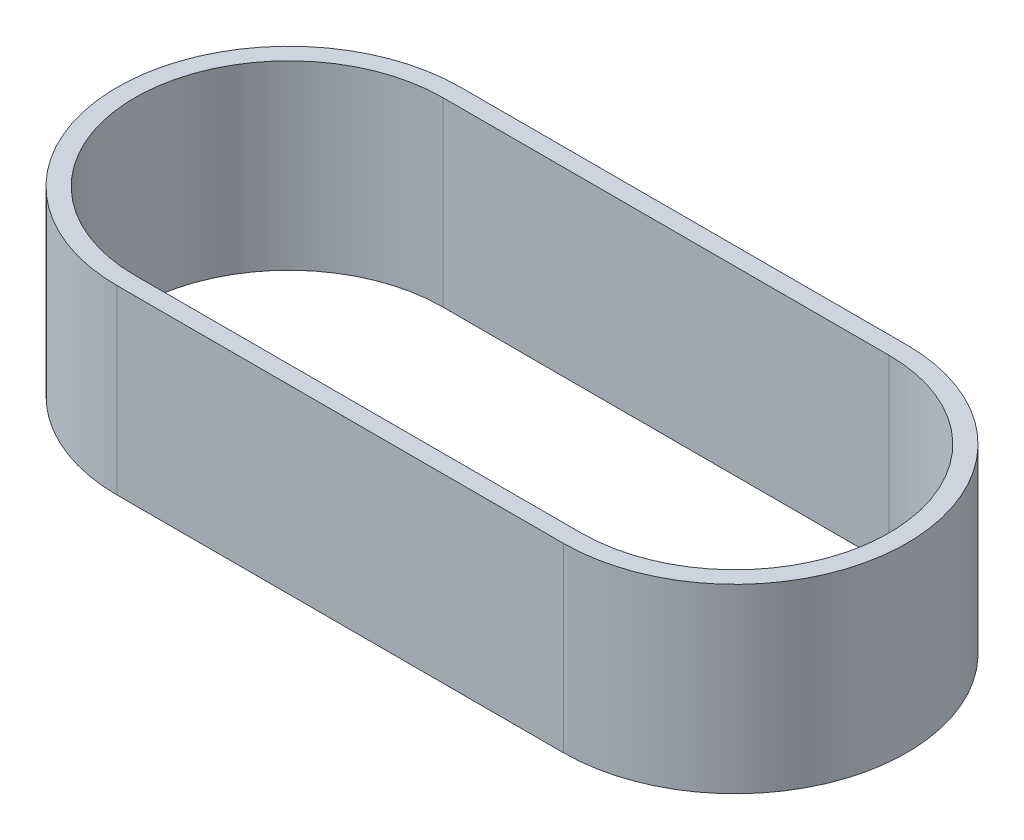
ISO-10303-21;
HEADER;
FILE_DESCRIPTION(('STEP AP214'),'2;1');
FILE_NAME('part.step','',(''),(''),'','','');
FILE_SCHEMA(('AUTOMOTIVE_DESIGN { 1 0 10303 214 1 1 1 1 }'));
ENDSEC;
DATA;
#1=APPLICATION_CONTEXT('core data for automotive mechanical design processes');
#2=APPLICATION_PROTOCOL_DEFINITION('international standard','automotive_design',2000,#1);
#3=PRODUCT_CONTEXT('',#1,'mechanical');
#4=PRODUCT('Part','Part','',(#3));
#5=PRODUCT_RELATED_PRODUCT_CATEGORY('part','',(#4));
#6=PRODUCT_DEFINITION_FORMATION('','',#4);
#7=PRODUCT_DEFINITION_CONTEXT('part definition',#1,'design');
#8=PRODUCT_DEFINITION('design','',#6,#7);
#9=PRODUCT_DEFINITION_SHAPE('','',#8);
#10=(LENGTH_UNIT() NAMED_UNIT(*) SI_UNIT(.MILLI.,.METRE.));
#11=(NAMED_UNIT(*) PLANE_ANGLE_UNIT() SI_UNIT($,.RADIAN.));
#12=(NAMED_UNIT(*) SI_UNIT($,.STERADIAN.) SOLID_ANGLE_UNIT());
#13=UNCERTAINTY_MEASURE_WITH_UNIT(LENGTH_MEASURE(1.E-05),#10,'distance_accuracy_value','');
#14=(GEOMETRIC_REPRESENTATION_CONTEXT(3) GLOBAL_UNCERTAINTY_ASSIGNED_CONTEXT((#13)) GLOBAL_UNIT_ASSIGNED_CONTEXT((#10,
#11,#12)) REPRESENTATION_CONTEXT('',''));
#15=CARTESIAN_POINT('',(0.,0.,0.));
#16=DIRECTION('',(0.,0.,1.));
#17=DIRECTION('',(1.,0.,0.));
#18=AXIS2_PLACEMENT_3D('',#15,#16,#17);
#19=CARTESIAN_POINT('',(-85.1338117099973,20.32,-33.173613830391));
#20=DIRECTION('',(0.,1.,0.));
#21=DIRECTION('',(0.,0.,1.));
#22=AXIS2_PLACEMENT_3D('',#19,#20,#21);
#23=PLANE('',#22);
#24=CARTESIAN_POINT('',(-85.1338117099973,20.32,-33.173613830391));
#25=DIRECTION('',(0.,1.,0.));
#26=DIRECTION('',(0.,0.,1.));
#27=AXIS2_PLACEMENT_3D('',#24,#25,#26);
#28=CIRCLE('',#27,19.2442487240887);
#29=CARTESIAN_POINT('',(-85.1338117099973,20.32,-52.4178625544797));
#30=VERTEX_POINT('',#29);
#31=CARTESIAN_POINT('',(-85.1338117099973,20.32,-13.9293651063024));
#32=VERTEX_POINT('',#31);
#33=EDGE_CURVE('E140',#30,#32,#28,.T.);
#34=ORIENTED_EDGE('',*,*,#33,.T.);
#35=DIRECTION('',(1.,0.,0.));
#36=VECTOR('',#35,1.);
#37=CARTESIAN_POINT('',(-85.1338117099973,20.32,-13.9293651063024));
#38=LINE('',#37,#36);
#39=CARTESIAN_POINT('',(-35.1338117099973,20.32,-13.9293651063024));
#40=VERTEX_POINT('',#39);
#41=EDGE_CURVE('E143',#32,#40,#38,.T.);
#42=ORIENTED_EDGE('',*,*,#41,.T.);
#43=CARTESIAN_POINT('',(-35.1338117099973,20.32,-33.173613830391));
#44=DIRECTION('',(0.,1.,0.));
#45=DIRECTION('',(0.,0.,1.));
#46=AXIS2_PLACEMENT_3D('',#43,#44,#45);
#47=CIRCLE('',#46,19.2442487240887);
#48=CARTESIAN_POINT('',(-35.1338117099973,20.32,-52.4178625544797));
#49=VERTEX_POINT('',#48);
#50=EDGE_CURVE('E146',#40,#49,#47,.T.);
#51=ORIENTED_EDGE('',*,*,#50,.T.);
#52=DIRECTION('',(-1.,0.,0.));
#53=VECTOR('',#52,1.);
#54=CARTESIAN_POINT('',(-85.1338117099973,20.32,-52.4178625544797));
#55=LINE('',#54,#53);
#56=EDGE_CURVE('E148',#49,#30,#55,.T.);
#57=ORIENTED_EDGE('',*,*,#56,.T.);
#58=EDGE_LOOP('',(#34,#42,#51,#57));
#59=FACE_BOUND('',#58,.T.);
#60=DIRECTION('',(1.,0.,0.));
#61=VECTOR('',#60,1.);
#62=CARTESIAN_POINT('',(-85.1338117099973,20.32,-15.9293651063024));
#63=LINE('',#62,#61);
#64=CARTESIAN_POINT('',(-85.1338117099973,20.32,-15.9293651063024));
#65=VERTEX_POINT('',#64);
#66=CARTESIAN_POINT('',(-35.1338117099973,20.32,-15.9293651063024));
#67=VERTEX_POINT('',#66);
#68=EDGE_CURVE('E112',#65,#67,#63,.T.);
#69=ORIENTED_EDGE('',*,*,#68,.F.);
#70=CARTESIAN_POINT('',(-85.1338117099973,20.32,-33.173613830391));
#71=DIRECTION('',(0.,1.,0.));
#72=DIRECTION('',(0.,0.,1.));
#73=AXIS2_PLACEMENT_3D('',#70,#71,#72);
#74=CIRCLE('',#73,17.2442487240887);
#75=CARTESIAN_POINT('',(-85.1338117099973,20.32,-50.4178625544797));
#76=VERTEX_POINT('',#75);
#77=EDGE_CURVE('E104',#76,#65,#74,.T.);
#78=ORIENTED_EDGE('',*,*,#77,.F.);
#79=DIRECTION('',(-1.,0.,0.));
#80=VECTOR('',#79,1.);
#81=CARTESIAN_POINT('',(-85.1338117099973,20.32,-50.4178625544797));
#82=LINE('',#81,#80);
#83=CARTESIAN_POINT('',(-35.1338117099973,20.32,-50.4178625544797));
#84=VERTEX_POINT('',#83);
#85=EDGE_CURVE('E126',#84,#76,#82,.T.);
#86=ORIENTED_EDGE('',*,*,#85,.F.);
#87=CARTESIAN_POINT('',(-35.1338117099973,20.32,-33.173613830391));
#88=DIRECTION('',(0.,1.,0.));
#89=DIRECTION('',(0.,0.,1.));
#90=AXIS2_PLACEMENT_3D('',#87,#88,#89);
#91=CIRCLE('',#90,17.2442487240887);
#92=EDGE_CURVE('E124',#67,#84,#91,.T.);
#93=ORIENTED_EDGE('',*,*,#92,.F.);
#94=EDGE_LOOP('',(#69,#78,#86,#93));
#95=FACE_BOUND('',#94,.T.);
#96=ADVANCED_FACE('F39',(#59,#95),#23,.T.);
#97=CARTESIAN_POINT('',(-85.1338117099973,0.,-33.173613830391));
#98=DIRECTION('',(0.,1.,0.));
#99=DIRECTION('',(0.,0.,1.));
#100=AXIS2_PLACEMENT_3D('',#97,#98,#99);
#101=PLANE('',#100);
#102=CARTESIAN_POINT('',(-85.1338117099973,0.,-33.173613830391));
#103=DIRECTION('',(0.,1.,0.));
#104=DIRECTION('',(0.,0.,1.));
#105=AXIS2_PLACEMENT_3D('',#102,#103,#104);
#106=CIRCLE('',#105,19.2442487240887);
#107=CARTESIAN_POINT('',(-85.1338117099973,0.,-52.4178625544797));
#108=VERTEX_POINT('',#107);
#109=CARTESIAN_POINT('',(-85.1338117099973,0.,-13.9293651063024));
#110=VERTEX_POINT('',#109);
#111=EDGE_CURVE('E120',#108,#110,#106,.T.);
#112=ORIENTED_EDGE('',*,*,#111,.F.);
#113=DIRECTION('',(-1.,0.,0.));
#114=VECTOR('',#113,1.);
#115=CARTESIAN_POINT('',(-85.1338117099973,0.,-52.4178625544797));
#116=LINE('',#115,#114);
#117=CARTESIAN_POINT('',(-35.1338117099973,0.,-52.4178625544797));
#118=VERTEX_POINT('',#117);
#119=EDGE_CURVE('E144',#118,#108,#116,.T.);
#120=ORIENTED_EDGE('',*,*,#119,.F.);
#121=CARTESIAN_POINT('',(-35.1338117099973,0.,-33.173613830391));
#122=DIRECTION('',(0.,1.,0.));
#123=DIRECTION('',(0.,0.,1.));
#124=AXIS2_PLACEMENT_3D('',#121,#122,#123);
#125=CIRCLE('',#124,19.2442487240887);
#126=CARTESIAN_POINT('',(-35.1338117099973,0.,-13.9293651063024));
#127=VERTEX_POINT('',#126);
#128=EDGE_CURVE('E155',#127,#118,#125,.T.);
#129=ORIENTED_EDGE('',*,*,#128,.F.);
#130=DIRECTION('',(1.,0.,0.));
#131=VECTOR('',#130,1.);
#132=CARTESIAN_POINT('',(-85.1338117099973,0.,-13.9293651063024));
#133=LINE('',#132,#131);
#134=EDGE_CURVE('E153',#110,#127,#133,.T.);
#135=ORIENTED_EDGE('',*,*,#134,.F.);
#136=EDGE_LOOP('',(#112,#120,#129,#135));
#137=FACE_BOUND('',#136,.T.);
#138=CARTESIAN_POINT('',(-85.1338117099973,0.,-33.173613830391));
#139=DIRECTION('',(0.,1.,0.));
#140=DIRECTION('',(0.,0.,1.));
#141=AXIS2_PLACEMENT_3D('',#138,#139,#140);
#142=CIRCLE('',#141,17.2442487240887);
#143=CARTESIAN_POINT('',(-85.1338117099973,0.,-50.4178625544797));
#144=VERTEX_POINT('',#143);
#145=CARTESIAN_POINT('',(-85.1338117099973,0.,-15.9293651063024));
#146=VERTEX_POINT('',#145);
#147=EDGE_CURVE('E62',#144,#146,#142,.T.);
#148=ORIENTED_EDGE('',*,*,#147,.T.);
#149=DIRECTION('',(1.,0.,0.));
#150=VECTOR('',#149,1.);
#151=CARTESIAN_POINT('',(-85.1338117099973,0.,-15.9293651063024));
#152=LINE('',#151,#150);
#153=CARTESIAN_POINT('',(-35.1338117099973,0.,-15.9293651063024));
#154=VERTEX_POINT('',#153);
#155=EDGE_CURVE('E119',#146,#154,#152,.T.);
#156=ORIENTED_EDGE('',*,*,#155,.T.);
#157=CARTESIAN_POINT('',(-35.1338117099973,0.,-33.173613830391));
#158=DIRECTION('',(0.,1.,0.));
#159=DIRECTION('',(0.,0.,1.));
#160=AXIS2_PLACEMENT_3D('',#157,#158,#159);
#161=CIRCLE('',#160,17.2442487240887);
#162=CARTESIAN_POINT('',(-35.1338117099973,0.,-50.4178625544797));
#163=VERTEX_POINT('',#162);
#164=EDGE_CURVE('E132',#154,#163,#161,.T.);
#165=ORIENTED_EDGE('',*,*,#164,.T.);
#166=DIRECTION('',(-1.,0.,0.));
#167=VECTOR('',#166,1.);
#168=CARTESIAN_POINT('',(-85.1338117099973,0.,-50.4178625544797));
#169=LINE('',#168,#167);
#170=EDGE_CURVE('E113',#163,#144,#169,.T.);
#171=ORIENTED_EDGE('',*,*,#170,.T.);
#172=EDGE_LOOP('',(#148,#156,#165,#171));
#173=FACE_BOUND('',#172,.T.);
#174=ADVANCED_FACE('F173',(#137,#173),#101,.F.);
#175=CARTESIAN_POINT('',(-85.1338117099973,20.32,-33.173613830391));
#176=DIRECTION('',(0.,-1.,0.));
#177=DIRECTION('',(0.,0.,-1.));
#178=AXIS2_PLACEMENT_3D('',#175,#176,#177);
#179=CYLINDRICAL_SURFACE('',#178,19.2442487240887);
#180=ORIENTED_EDGE('',*,*,#111,.T.);
#181=DIRECTION('',(0.,-1.,0.));
#182=VECTOR('',#181,1.);
#183=CARTESIAN_POINT('',(-85.1338117099973,20.32,-13.9293651063024));
#184=LINE('',#183,#182);
#185=EDGE_CURVE('E11',#32,#110,#184,.T.);
#186=ORIENTED_EDGE('',*,*,#185,.F.);
#187=ORIENTED_EDGE('',*,*,#33,.F.);
#188=DIRECTION('',(0.,-1.,0.));
#189=VECTOR('',#188,1.);
#190=CARTESIAN_POINT('',(-85.1338117099973,20.32,-52.4178625544797));
#191=LINE('',#190,#189);
#192=EDGE_CURVE('E150',#30,#108,#191,.T.);
#193=ORIENTED_EDGE('',*,*,#192,.T.);
#194=EDGE_LOOP('',(#180,#186,#187,#193));
#195=FACE_BOUND('',#194,.T.);
#196=ADVANCED_FACE('F41',(#195),#179,.T.);
#197=CARTESIAN_POINT('',(-85.1338117099973,20.32,-13.9293651063024));
#198=DIRECTION('',(0.,0.,-1.));
#199=DIRECTION('',(-1.,0.,0.));
#200=AXIS2_PLACEMENT_3D('',#197,#198,#199);
#201=PLANE('',#200);
#202=ORIENTED_EDGE('',*,*,#134,.T.);
#203=DIRECTION('',(0.,-1.,0.));
#204=VECTOR('',#203,1.);
#205=CARTESIAN_POINT('',(-35.1338117099973,20.32,-13.9293651063024));
#206=LINE('',#205,#204);
#207=EDGE_CURVE('E47',#40,#127,#206,.T.);
#208=ORIENTED_EDGE('',*,*,#207,.F.);
#209=ORIENTED_EDGE('',*,*,#41,.F.);
#210=ORIENTED_EDGE('',*,*,#185,.T.);
#211=EDGE_LOOP('',(#202,#208,#209,#210));
#212=FACE_BOUND('',#211,.T.);
#213=ADVANCED_FACE('F183',(#212),#201,.F.);
#214=CARTESIAN_POINT('',(-35.1338117099973,20.32,-33.173613830391));
#215=DIRECTION('',(0.,-1.,0.));
#216=DIRECTION('',(0.,0.,-1.));
#217=AXIS2_PLACEMENT_3D('',#214,#215,#216);
#218=CYLINDRICAL_SURFACE('',#217,19.2442487240887);
#219=ORIENTED_EDGE('',*,*,#128,.T.);
#220=DIRECTION('',(0.,-1.,0.));
#221=VECTOR('',#220,1.);
#222=CARTESIAN_POINT('',(-35.1338117099973,20.32,-52.4178625544797));
#223=LINE('',#222,#221);
#224=EDGE_CURVE('E160',#49,#118,#223,.T.);
#225=ORIENTED_EDGE('',*,*,#224,.F.);
#226=ORIENTED_EDGE('',*,*,#50,.F.);
#227=ORIENTED_EDGE('',*,*,#207,.T.);
#228=EDGE_LOOP('',(#219,#225,#226,#227));
#229=FACE_BOUND('',#228,.T.);
#230=ADVANCED_FACE('F167',(#229),#218,.T.);
#231=CARTESIAN_POINT('',(-85.1338117099973,20.32,-52.4178625544797));
#232=DIRECTION('',(0.,0.,1.));
#233=DIRECTION('',(1.,0.,0.));
#234=AXIS2_PLACEMENT_3D('',#231,#232,#233);
#235=PLANE('',#234);
#236=ORIENTED_EDGE('',*,*,#119,.T.);
#237=ORIENTED_EDGE('',*,*,#192,.F.);
#238=ORIENTED_EDGE('',*,*,#56,.F.);
#239=ORIENTED_EDGE('',*,*,#224,.T.);
#240=EDGE_LOOP('',(#236,#237,#238,#239));
#241=FACE_BOUND('',#240,.T.);
#242=ADVANCED_FACE('F177',(#241),#235,.F.);
#243=CARTESIAN_POINT('',(-85.1338117099973,20.32,-33.173613830391));
#244=DIRECTION('',(0.,-1.,0.));
#245=DIRECTION('',(0.,0.,-1.));
#246=AXIS2_PLACEMENT_3D('',#243,#244,#245);
#247=CYLINDRICAL_SURFACE('',#246,17.2442487240887);
#248=ORIENTED_EDGE('',*,*,#147,.F.);
#249=DIRECTION('',(0.,-1.,0.));
#250=VECTOR('',#249,1.);
#251=CARTESIAN_POINT('',(-85.1338117099973,20.32,-50.4178625544797));
#252=LINE('',#251,#250);
#253=EDGE_CURVE('E108',#76,#144,#252,.T.);
#254=ORIENTED_EDGE('',*,*,#253,.F.);
#255=ORIENTED_EDGE('',*,*,#77,.T.);
#256=DIRECTION('',(0.,-1.,0.));
#257=VECTOR('',#256,1.);
#258=CARTESIAN_POINT('',(-85.1338117099973,20.32,-15.9293651063024));
#259=LINE('',#258,#257);
#260=EDGE_CURVE('E107',#65,#146,#259,.T.);
#261=ORIENTED_EDGE('',*,*,#260,.T.);
#262=EDGE_LOOP('',(#248,#254,#255,#261));
#263=FACE_BOUND('',#262,.T.);
#264=ADVANCED_FACE('F106',(#263),#247,.F.);
#265=CARTESIAN_POINT('',(-85.1338117099973,20.32,-15.9293651063024));
#266=DIRECTION('',(0.,0.,-1.));
#267=DIRECTION('',(-1.,0.,0.));
#268=AXIS2_PLACEMENT_3D('',#265,#266,#267);
#269=PLANE('',#268);
#270=ORIENTED_EDGE('',*,*,#155,.F.);
#271=ORIENTED_EDGE('',*,*,#260,.F.);
#272=ORIENTED_EDGE('',*,*,#68,.T.);
#273=DIRECTION('',(0.,-1.,0.));
#274=VECTOR('',#273,1.);
#275=CARTESIAN_POINT('',(-35.1338117099973,20.32,-15.9293651063024));
#276=LINE('',#275,#274);
#277=EDGE_CURVE('E121',#67,#154,#276,.T.);
#278=ORIENTED_EDGE('',*,*,#277,.T.);
#279=EDGE_LOOP('',(#270,#271,#272,#278));
#280=FACE_BOUND('',#279,.T.);
#281=ADVANCED_FACE('F116',(#280),#269,.T.);
#282=CARTESIAN_POINT('',(-35.1338117099973,20.32,-33.173613830391));
#283=DIRECTION('',(0.,-1.,0.));
#284=DIRECTION('',(0.,0.,-1.));
#285=AXIS2_PLACEMENT_3D('',#282,#283,#284);
#286=CYLINDRICAL_SURFACE('',#285,17.2442487240887);
#287=ORIENTED_EDGE('',*,*,#164,.F.);
#288=ORIENTED_EDGE('',*,*,#277,.F.);
#289=ORIENTED_EDGE('',*,*,#92,.T.);
#290=DIRECTION('',(0.,-1.,0.));
#291=VECTOR('',#290,1.);
#292=CARTESIAN_POINT('',(-35.1338117099973,20.32,-50.4178625544797));
#293=LINE('',#292,#291);
#294=EDGE_CURVE('E54',#84,#163,#293,.T.);
#295=ORIENTED_EDGE('',*,*,#294,.T.);
#296=EDGE_LOOP('',(#287,#288,#289,#295));
#297=FACE_BOUND('',#296,.T.);
#298=ADVANCED_FACE('F206',(#297),#286,.F.);
#299=CARTESIAN_POINT('',(-85.1338117099973,20.32,-50.4178625544797));
#300=DIRECTION('',(0.,0.,1.));
#301=DIRECTION('',(1.,0.,0.));
#302=AXIS2_PLACEMENT_3D('',#299,#300,#301);
#303=PLANE('',#302);
#304=ORIENTED_EDGE('',*,*,#170,.F.);
#305=ORIENTED_EDGE('',*,*,#294,.F.);
#306=ORIENTED_EDGE('',*,*,#85,.T.);
#307=ORIENTED_EDGE('',*,*,#253,.T.);
#308=EDGE_LOOP('',(#304,#305,#306,#307));
#309=FACE_BOUND('',#308,.T.);
#310=ADVANCED_FACE('F210',(#309),#303,.T.);
#311=CLOSED_SHELL('',(#96,#174,#196,#213,#230,#242,#264,#281,#298,#310));
#312=MANIFOLD_SOLID_BREP('B2',#311);
#313=ADVANCED_BREP_SHAPE_REPRESENTATION('',(#18,#312),#14);
#314=SHAPE_DEFINITION_REPRESENTATION(#9,#313);
ENDSEC;
END-ISO-10303-21;
